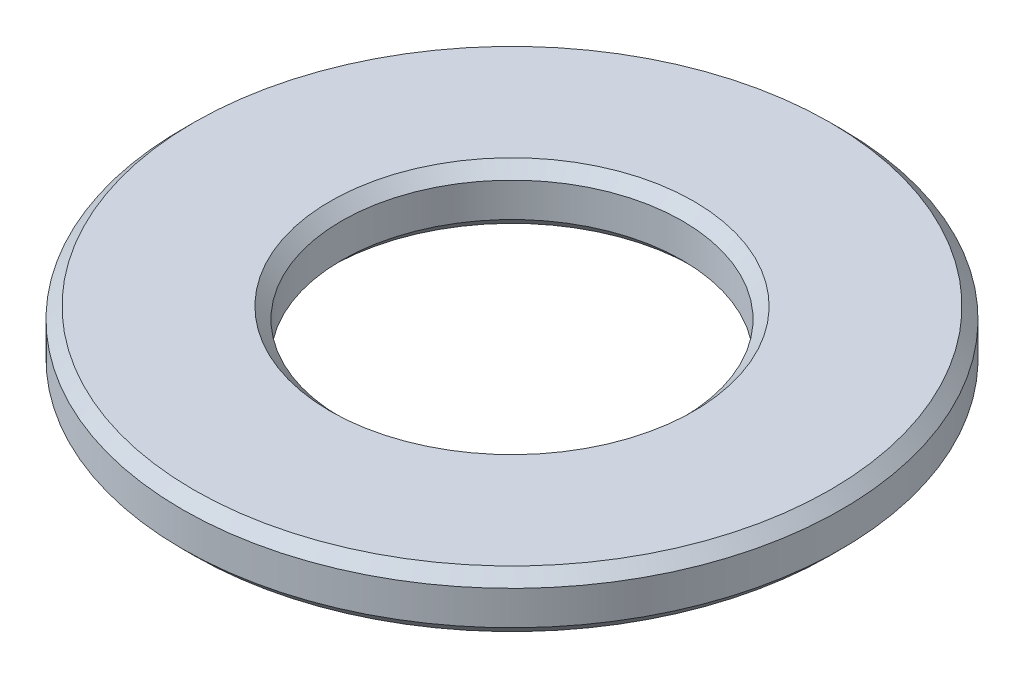
ISO-10303-21;
HEADER;
FILE_DESCRIPTION(('STEP AP214'),'2;1');
FILE_NAME('part.step','',(''),(''),'','','');
FILE_SCHEMA(('AUTOMOTIVE_DESIGN { 1 0 10303 214 1 1 1 1 }'));
ENDSEC;
DATA;
#1=APPLICATION_CONTEXT('core data for automotive mechanical design processes');
#2=APPLICATION_PROTOCOL_DEFINITION('international standard','automotive_design',2000,#1);
#3=PRODUCT_CONTEXT('',#1,'mechanical');
#4=PRODUCT('Part','Part','',(#3));
#5=PRODUCT_RELATED_PRODUCT_CATEGORY('part','',(#4));
#6=PRODUCT_DEFINITION_FORMATION('','',#4);
#7=PRODUCT_DEFINITION_CONTEXT('part definition',#1,'design');
#8=PRODUCT_DEFINITION('design','',#6,#7);
#9=PRODUCT_DEFINITION_SHAPE('','',#8);
#10=(LENGTH_UNIT() NAMED_UNIT(*) SI_UNIT(.MILLI.,.METRE.));
#11=(NAMED_UNIT(*) PLANE_ANGLE_UNIT() SI_UNIT($,.RADIAN.));
#12=(NAMED_UNIT(*) SI_UNIT($,.STERADIAN.) SOLID_ANGLE_UNIT());
#13=UNCERTAINTY_MEASURE_WITH_UNIT(LENGTH_MEASURE(1.E-05),#10,'distance_accuracy_value','');
#14=(GEOMETRIC_REPRESENTATION_CONTEXT(3) GLOBAL_UNCERTAINTY_ASSIGNED_CONTEXT((#13)) GLOBAL_UNIT_ASSIGNED_CONTEXT((#10,
#11,#12)) REPRESENTATION_CONTEXT('',''));
#15=CARTESIAN_POINT('',(0.,0.,0.));
#16=DIRECTION('',(0.,0.,1.));
#17=DIRECTION('',(1.,0.,0.));
#18=AXIS2_PLACEMENT_3D('',#15,#16,#17);
#19=CARTESIAN_POINT('',(0.,0.5,0.));
#20=DIRECTION('',(0.,1.,0.));
#21=DIRECTION('',(0.,0.,1.));
#22=AXIS2_PLACEMENT_3D('',#19,#20,#21);
#23=PLANE('',#22);
#24=CARTESIAN_POINT('',(0.,0.5,0.));
#25=DIRECTION('',(0.,1.,0.));
#26=DIRECTION('',(0.,0.,1.));
#27=AXIS2_PLACEMENT_3D('',#24,#25,#26);
#28=CIRCLE('',#27,1.6);
#29=CARTESIAN_POINT('',(0.,0.5,1.6));
#30=VERTEX_POINT('',#29);
#31=EDGE_CURVE('E10',#30,#30,#28,.F.);
#32=ORIENTED_EDGE('',*,*,#31,.T.);
#33=EDGE_LOOP('',(#32));
#34=FACE_BOUND('',#33,.T.);
#35=CARTESIAN_POINT('',(0.,0.5,0.));
#36=DIRECTION('',(0.,1.,0.));
#37=DIRECTION('',(0.,0.,1.));
#38=AXIS2_PLACEMENT_3D('',#35,#36,#37);
#39=CIRCLE('',#38,2.8);
#40=CARTESIAN_POINT('',(0.,0.5,2.8));
#41=VERTEX_POINT('',#40);
#42=EDGE_CURVE('E44',#41,#41,#39,.T.);
#43=ORIENTED_EDGE('',*,*,#42,.T.);
#44=EDGE_LOOP('',(#43));
#45=FACE_BOUND('',#44,.T.);
#46=ADVANCED_FACE('F37',(#34,#45),#23,.T.);
#47=CARTESIAN_POINT('',(0.,0.,0.));
#48=DIRECTION('',(0.,1.,0.));
#49=DIRECTION('',(0.,0.,1.));
#50=AXIS2_PLACEMENT_3D('',#47,#48,#49);
#51=PLANE('',#50);
#52=CARTESIAN_POINT('',(0.,0.,0.));
#53=DIRECTION('',(0.,1.,0.));
#54=DIRECTION('',(0.,0.,1.));
#55=AXIS2_PLACEMENT_3D('',#52,#53,#54);
#56=CIRCLE('',#55,2.8);
#57=CARTESIAN_POINT('',(0.,0.,2.8));
#58=VERTEX_POINT('',#57);
#59=EDGE_CURVE('E57',#58,#58,#56,.F.);
#60=ORIENTED_EDGE('',*,*,#59,.T.);
#61=EDGE_LOOP('',(#60));
#62=FACE_BOUND('',#61,.T.);
#63=CARTESIAN_POINT('',(0.,0.,0.));
#64=DIRECTION('',(0.,1.,0.));
#65=DIRECTION('',(0.,0.,1.));
#66=AXIS2_PLACEMENT_3D('',#63,#64,#65);
#67=CIRCLE('',#66,1.6);
#68=CARTESIAN_POINT('',(0.,0.,1.6));
#69=VERTEX_POINT('',#68);
#70=EDGE_CURVE('E60',#69,#69,#67,.T.);
#71=ORIENTED_EDGE('',*,*,#70,.T.);
#72=EDGE_LOOP('',(#71));
#73=FACE_BOUND('',#72,.T.);
#74=ADVANCED_FACE('F81',(#62,#73),#51,.F.);
#75=CARTESIAN_POINT('',(0.,0.5,0.));
#76=DIRECTION('',(0.,-1.,0.));
#77=DIRECTION('',(0.,0.,-1.));
#78=AXIS2_PLACEMENT_3D('',#75,#76,#77);
#79=CYLINDRICAL_SURFACE('',#78,2.9);
#80=CARTESIAN_POINT('',(0.,0.0999999999999998,0.));
#81=DIRECTION('',(0.,1.,0.));
#82=DIRECTION('',(0.,0.,1.));
#83=AXIS2_PLACEMENT_3D('',#80,#81,#82);
#84=CIRCLE('',#83,2.9);
#85=CARTESIAN_POINT('',(0.,0.0999999999999998,2.9));
#86=VERTEX_POINT('',#85);
#87=EDGE_CURVE('E63',#86,#86,#84,.T.);
#88=ORIENTED_EDGE('',*,*,#87,.T.);
#89=EDGE_LOOP('',(#88));
#90=FACE_BOUND('',#89,.T.);
#91=CARTESIAN_POINT('',(0.,0.400000000000001,0.));
#92=DIRECTION('',(0.,1.,0.));
#93=DIRECTION('',(0.,0.,1.));
#94=AXIS2_PLACEMENT_3D('',#91,#92,#93);
#95=CIRCLE('',#94,2.9);
#96=CARTESIAN_POINT('',(0.,0.400000000000001,2.9));
#97=VERTEX_POINT('',#96);
#98=EDGE_CURVE('E66',#97,#97,#95,.F.);
#99=ORIENTED_EDGE('',*,*,#98,.T.);
#100=EDGE_LOOP('',(#99));
#101=FACE_BOUND('',#100,.T.);
#102=ADVANCED_FACE('F70',(#90,#101),#79,.T.);
#103=CARTESIAN_POINT('',(0.,0.5,0.));
#104=DIRECTION('',(0.,-1.,0.));
#105=DIRECTION('',(0.,0.,-1.));
#106=AXIS2_PLACEMENT_3D('',#103,#104,#105);
#107=CYLINDRICAL_SURFACE('',#106,1.5);
#108=CARTESIAN_POINT('',(0.,0.100000000000001,0.));
#109=DIRECTION('',(0.,1.,0.));
#110=DIRECTION('',(0.,0.,1.));
#111=AXIS2_PLACEMENT_3D('',#108,#109,#110);
#112=CIRCLE('',#111,1.5);
#113=CARTESIAN_POINT('',(0.,0.100000000000001,1.5));
#114=VERTEX_POINT('',#113);
#115=EDGE_CURVE('E48',#114,#114,#112,.F.);
#116=ORIENTED_EDGE('',*,*,#115,.T.);
#117=EDGE_LOOP('',(#116));
#118=FACE_BOUND('',#117,.T.);
#119=CARTESIAN_POINT('',(0.,0.399999999999998,0.));
#120=DIRECTION('',(0.,1.,0.));
#121=DIRECTION('',(0.,0.,1.));
#122=AXIS2_PLACEMENT_3D('',#119,#120,#121);
#123=CIRCLE('',#122,1.5);
#124=CARTESIAN_POINT('',(0.,0.399999999999998,1.5));
#125=VERTEX_POINT('',#124);
#126=EDGE_CURVE('E52',#125,#125,#123,.T.);
#127=ORIENTED_EDGE('',*,*,#126,.T.);
#128=EDGE_LOOP('',(#127));
#129=FACE_BOUND('',#128,.T.);
#130=ADVANCED_FACE('F89',(#118,#129),#107,.F.);
#131=CARTESIAN_POINT('',(0.,0.0999999999999998,0.));
#132=DIRECTION('',(0.,1.,0.));
#133=DIRECTION('',(0.,0.,1.));
#134=AXIS2_PLACEMENT_3D('',#131,#132,#133);
#135=CONICAL_SURFACE('',#134,2.9,0.78539816339745);
#136=ORIENTED_EDGE('',*,*,#59,.F.);
#137=EDGE_LOOP('',(#136));
#138=FACE_BOUND('',#137,.T.);
#139=ORIENTED_EDGE('',*,*,#87,.F.);
#140=EDGE_LOOP('',(#139));
#141=FACE_BOUND('',#140,.T.);
#142=ADVANCED_FACE('F94',(#138,#141),#135,.T.);
#143=CARTESIAN_POINT('',(0.,0.,0.));
#144=DIRECTION('',(0.,-1.,0.));
#145=DIRECTION('',(0.,0.,-1.));
#146=AXIS2_PLACEMENT_3D('',#143,#144,#145);
#147=CONICAL_SURFACE('',#146,1.6,0.785398163397446);
#148=ORIENTED_EDGE('',*,*,#115,.F.);
#149=EDGE_LOOP('',(#148));
#150=FACE_BOUND('',#149,.T.);
#151=ORIENTED_EDGE('',*,*,#70,.F.);
#152=EDGE_LOOP('',(#151));
#153=FACE_BOUND('',#152,.T.);
#154=ADVANCED_FACE('F78',(#150,#153),#147,.F.);
#155=CARTESIAN_POINT('',(0.,0.399999999999998,0.));
#156=DIRECTION('',(0.,1.,0.));
#157=DIRECTION('',(0.,0.,1.));
#158=AXIS2_PLACEMENT_3D('',#155,#156,#157);
#159=CONICAL_SURFACE('',#158,1.5,0.785398163397449);
#160=ORIENTED_EDGE('',*,*,#31,.F.);
#161=EDGE_LOOP('',(#160));
#162=FACE_BOUND('',#161,.T.);
#163=ORIENTED_EDGE('',*,*,#126,.F.);
#164=EDGE_LOOP('',(#163));
#165=FACE_BOUND('',#164,.T.);
#166=ADVANCED_FACE('F74',(#162,#165),#159,.F.);
#167=CARTESIAN_POINT('',(0.,0.5,0.));
#168=DIRECTION('',(0.,-1.,0.));
#169=DIRECTION('',(0.,0.,-1.));
#170=AXIS2_PLACEMENT_3D('',#167,#168,#169);
#171=CONICAL_SURFACE('',#170,2.8,0.78539816339745);
#172=ORIENTED_EDGE('',*,*,#98,.F.);
#173=EDGE_LOOP('',(#172));
#174=FACE_BOUND('',#173,.T.);
#175=ORIENTED_EDGE('',*,*,#42,.F.);
#176=EDGE_LOOP('',(#175));
#177=FACE_BOUND('',#176,.T.);
#178=ADVANCED_FACE('F39',(#174,#177),#171,.T.);
#179=CLOSED_SHELL('',(#46,#74,#102,#130,#142,#154,#166,#178));
#180=MANIFOLD_SOLID_BREP('B2',#179);
#181=ADVANCED_BREP_SHAPE_REPRESENTATION('',(#18,#180),#14);
#182=SHAPE_DEFINITION_REPRESENTATION(#9,#181);
ENDSEC;
END-ISO-10303-21;
